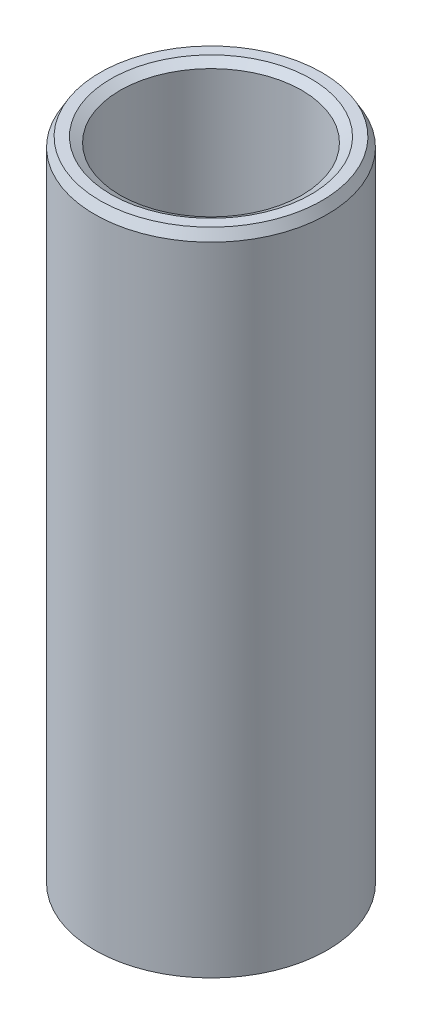
ISO-10303-21;
HEADER;
FILE_DESCRIPTION(('STEP AP214'),'2;1');
FILE_NAME('part.step','',(''),(''),'','','');
FILE_SCHEMA(('AUTOMOTIVE_DESIGN { 1 0 10303 214 1 1 1 1 }'));
ENDSEC;
DATA;
#1=APPLICATION_CONTEXT('core data for automotive mechanical design processes');
#2=APPLICATION_PROTOCOL_DEFINITION('international standard','automotive_design',2000,#1);
#3=PRODUCT_CONTEXT('',#1,'mechanical');
#4=PRODUCT('Part','Part','',(#3));
#5=PRODUCT_RELATED_PRODUCT_CATEGORY('part','',(#4));
#6=PRODUCT_DEFINITION_FORMATION('','',#4);
#7=PRODUCT_DEFINITION_CONTEXT('part definition',#1,'design');
#8=PRODUCT_DEFINITION('design','',#6,#7);
#9=PRODUCT_DEFINITION_SHAPE('','',#8);
#10=(LENGTH_UNIT() NAMED_UNIT(*) SI_UNIT(.MILLI.,.METRE.));
#11=(NAMED_UNIT(*) PLANE_ANGLE_UNIT() SI_UNIT($,.RADIAN.));
#12=(NAMED_UNIT(*) SI_UNIT($,.STERADIAN.) SOLID_ANGLE_UNIT());
#13=UNCERTAINTY_MEASURE_WITH_UNIT(LENGTH_MEASURE(1.E-05),#10,'distance_accuracy_value','');
#14=(GEOMETRIC_REPRESENTATION_CONTEXT(3) GLOBAL_UNCERTAINTY_ASSIGNED_CONTEXT((#13)) GLOBAL_UNIT_ASSIGNED_CONTEXT((#10,
#11,#12)) REPRESENTATION_CONTEXT('',''));
#15=CARTESIAN_POINT('',(0.,0.,0.));
#16=DIRECTION('',(0.,0.,1.));
#17=DIRECTION('',(1.,0.,0.));
#18=AXIS2_PLACEMENT_3D('',#15,#16,#17);
#19=CARTESIAN_POINT('',(0.,168.103531058881,0.));
#20=DIRECTION('',(0.,-1.,0.));
#21=DIRECTION('',(0.,0.,-1.));
#22=AXIS2_PLACEMENT_3D('',#19,#20,#21);
#23=CYLINDRICAL_SURFACE('',#22,30.);
#24=CARTESIAN_POINT('',(0.,1.37773613267428,0.));
#25=DIRECTION('',(0.,1.,0.));
#26=DIRECTION('',(0.,0.,1.));
#27=AXIS2_PLACEMENT_3D('',#24,#25,#26);
#28=CIRCLE('',#27,30.);
#29=CARTESIAN_POINT('',(0.,1.37773613267428,-30.));
#30=VERTEX_POINT('',#29);
#31=EDGE_CURVE('E10',#30,#30,#28,.T.);
#32=CARTESIAN_POINT('',(0.,165.717222077666,0.));
#33=DIRECTION('',(0.,1.,0.));
#34=DIRECTION('',(0.,0.,1.));
#35=AXIS2_PLACEMENT_3D('',#32,#33,#34);
#36=CIRCLE('',#35,30.);
#37=CARTESIAN_POINT('',(0.,165.717222077666,-30.));
#38=VERTEX_POINT('',#37);
#39=EDGE_CURVE('E50',#38,#38,#36,.F.);
#40=CARTESIAN_POINT('',(0.,1.37773613267428,-30.));
#41=CARTESIAN_POINT('',(0.,3.08960577793461,-30.));
#42=CARTESIAN_POINT('',(0.,4.80147542319494,-30.));
#43=CARTESIAN_POINT('',(0.,8.2252147137156,-30.));
#44=CARTESIAN_POINT('',(0.,9.93708435897594,-30.));
#45=CARTESIAN_POINT('',(0.,13.3608236494966,-30.));
#46=CARTESIAN_POINT('',(0.,15.0726932947569,-30.));
#47=CARTESIAN_POINT('',(0.,18.4964325852776,-30.));
#48=CARTESIAN_POINT('',(0.,20.2083022305379,-30.));
#49=CARTESIAN_POINT('',(0.,23.6320415210586,-30.));
#50=CARTESIAN_POINT('',(0.,25.3439111663189,-30.));
#51=CARTESIAN_POINT('',(0.,28.7676504568396,-30.));
#52=CARTESIAN_POINT('',(0.,30.4795201020999,-30.));
#53=CARTESIAN_POINT('',(0.,33.9032593926205,-30.));
#54=CARTESIAN_POINT('',(0.,35.6151290378809,-30.));
#55=CARTESIAN_POINT('',(0.,39.0388683284015,-30.));
#56=CARTESIAN_POINT('',(0.,40.7507379736619,-30.));
#57=CARTESIAN_POINT('',(0.,44.1744772641825,-30.));
#58=CARTESIAN_POINT('',(0.,45.8863469094429,-30.));
#59=CARTESIAN_POINT('',(0.,49.3100861999635,-30.));
#60=CARTESIAN_POINT('',(0.,51.0219558452239,-30.));
#61=CARTESIAN_POINT('',(0.,54.4456951357445,-30.));
#62=CARTESIAN_POINT('',(0.,56.1575647810048,-30.));
#63=CARTESIAN_POINT('',(0.,59.5813040715255,-30.));
#64=CARTESIAN_POINT('',(0.,61.2931737167858,-30.));
#65=CARTESIAN_POINT('',(0.,64.7169130073065,-30.));
#66=CARTESIAN_POINT('',(0.,66.4287826525668,-30.));
#67=CARTESIAN_POINT('',(0.,69.8525219430875,-30.));
#68=CARTESIAN_POINT('',(0.,71.5643915883478,-30.));
#69=CARTESIAN_POINT('',(0.,74.9881308788685,-30.));
#70=CARTESIAN_POINT('',(0.,76.7000005241288,-30.));
#71=CARTESIAN_POINT('',(0.,80.1237398146495,-30.));
#72=CARTESIAN_POINT('',(0.,81.8356094599098,-30.));
#73=CARTESIAN_POINT('',(0.,85.2593487504304,-30.));
#74=CARTESIAN_POINT('',(0.,86.9712183956908,-30.));
#75=CARTESIAN_POINT('',(0.,90.3949576862114,-30.));
#76=CARTESIAN_POINT('',(0.,92.1068273314718,-30.));
#77=CARTESIAN_POINT('',(0.,95.5305666219924,-30.));
#78=CARTESIAN_POINT('',(0.,97.2424362672528,-30.));
#79=CARTESIAN_POINT('',(0.,100.666175557773,-30.));
#80=CARTESIAN_POINT('',(0.,102.378045203034,-30.));
#81=CARTESIAN_POINT('',(0.,105.801784493554,-30.));
#82=CARTESIAN_POINT('',(0.,107.513654138815,-30.));
#83=CARTESIAN_POINT('',(0.,110.937393429335,-30.));
#84=CARTESIAN_POINT('',(0.,112.649263074596,-30.));
#85=CARTESIAN_POINT('',(0.,116.073002365116,-30.));
#86=CARTESIAN_POINT('',(0.,117.784872010377,-30.));
#87=CARTESIAN_POINT('',(0.,121.208611300897,-30.));
#88=CARTESIAN_POINT('',(0.,122.920480946158,-30.));
#89=CARTESIAN_POINT('',(0.,126.344220236678,-30.));
#90=CARTESIAN_POINT('',(0.,128.056089881939,-30.));
#91=CARTESIAN_POINT('',(0.,131.479829172459,-30.));
#92=CARTESIAN_POINT('',(0.,133.19169881772,-30.));
#93=CARTESIAN_POINT('',(0.,136.61543810824,-30.));
#94=CARTESIAN_POINT('',(0.,138.327307753501,-30.));
#95=CARTESIAN_POINT('',(0.,141.751047044021,-30.));
#96=CARTESIAN_POINT('',(0.,143.462916689282,-30.));
#97=CARTESIAN_POINT('',(0.,146.886655979802,-30.));
#98=CARTESIAN_POINT('',(0.,148.598525625063,-30.));
#99=CARTESIAN_POINT('',(0.,152.022264915583,-30.));
#100=CARTESIAN_POINT('',(0.,153.734134560844,-30.));
#101=CARTESIAN_POINT('',(0.,157.157873851364,-30.));
#102=CARTESIAN_POINT('',(0.,158.869743496625,-30.));
#103=CARTESIAN_POINT('',(0.,162.293482787145,-30.));
#104=CARTESIAN_POINT('',(0.,164.005352432406,-30.));
#105=CARTESIAN_POINT('',(0.,165.717222077666,-30.));
#106=B_SPLINE_CURVE_WITH_KNOTS('',3,(#40,#41,#42,#43,#44,#45,#46,#47,#48,#49,#50,#51,#52,#53,
#54,#55,#56,#57,#58,#59,#60,#61,#62,#63,#64,#65,#66,#67,#68,#69,#70,#71,#72,#73,#74,#75,#76,#77,
#78,#79,#80,#81,#82,#83,#84,#85,#86,#87,#88,#89,#90,#91,#92,#93,#94,#95,#96,#97,#98,#99,#100,
#101,#102,#103,#104,#105),.UNSPECIFIED.,.F.,.F.,(4,2,2,2,2,2,2,2,2,2,2,2,2,2,2,2,2,2,2,2,2,2,2,
2,2,2,2,2,2,2,2,2,4),(0.,5.13560893578099,10.271217871562,15.406826807343,20.542435743124,
25.6780446789049,30.8136536146859,35.9492625504669,41.0848714862479,46.2204804220289,
51.3560893578099,56.4916982935909,61.6273072293719,66.7629161651529,71.8985251009339,
77.0341340367148,82.1697429724958,87.3053519082768,92.4409608440578,97.5765697798388,
102.71217871562,107.847787651401,112.983396587182,118.119005522963,123.254614458744,
128.390223394525,133.525832330306,138.661441266087,143.797050201868,148.932659137649,
154.06826807343,159.203877009211,164.339485944992),.UNSPECIFIED.);
#107=EDGE_CURVE('BSEAM39',#30,#38,#106,.T.);
#108=ORIENTED_EDGE('',*,*,#31,.T.);
#109=ORIENTED_EDGE('',*,*,#39,.T.);
#110=ORIENTED_EDGE('',*,*,#107,.T.);
#111=ORIENTED_EDGE('',*,*,#107,.F.);
#112=EDGE_LOOP('',(#108,#110,#109,#111));
#113=FACE_BOUND('',#112,.T.);
#114=ADVANCED_FACE('F39',(#113),#23,.T.);
#115=CARTESIAN_POINT('',(0.,168.103531058881,0.));
#116=DIRECTION('',(0.,1.,0.));
#117=DIRECTION('',(0.,0.,1.));
#118=AXIS2_PLACEMENT_3D('',#115,#116,#117);
#119=PLANE('',#118);
#120=CARTESIAN_POINT('',(0.,168.103531058881,0.));
#121=DIRECTION('',(0.,1.,0.));
#122=DIRECTION('',(0.,0.,1.));
#123=AXIS2_PLACEMENT_3D('',#120,#121,#122);
#124=CIRCLE('',#123,25.8177116797901);
#125=CARTESIAN_POINT('',(0.,168.103531058881,25.8177116797901));
#126=VERTEX_POINT('',#125);
#127=EDGE_CURVE('E58',#126,#126,#124,.F.);
#128=ORIENTED_EDGE('',*,*,#127,.T.);
#129=EDGE_LOOP('',(#128));
#130=FACE_BOUND('',#129,.T.);
#131=CARTESIAN_POINT('',(0.,168.103531058881,0.));
#132=DIRECTION('',(0.,1.,0.));
#133=DIRECTION('',(0.,0.,1.));
#134=AXIS2_PLACEMENT_3D('',#131,#132,#133);
#135=CIRCLE('',#134,28.6222638673258);
#136=CARTESIAN_POINT('',(0.,168.103531058881,28.6222638673258));
#137=VERTEX_POINT('',#136);
#138=EDGE_CURVE('E61',#137,#137,#135,.T.);
#139=ORIENTED_EDGE('',*,*,#138,.T.);
#140=EDGE_LOOP('',(#139));
#141=FACE_BOUND('',#140,.T.);
#142=ADVANCED_FACE('F88',(#130,#141),#119,.T.);
#143=CARTESIAN_POINT('',(0.,0.,0.));
#144=DIRECTION('',(0.,1.,0.));
#145=DIRECTION('',(0.,0.,1.));
#146=AXIS2_PLACEMENT_3D('',#143,#144,#145);
#147=PLANE('',#146);
#148=CARTESIAN_POINT('',(0.,0.,0.));
#149=DIRECTION('',(0.,1.,0.));
#150=DIRECTION('',(0.,0.,1.));
#151=AXIS2_PLACEMENT_3D('',#148,#149,#150);
#152=CIRCLE('',#151,24.809138831249);
#153=CARTESIAN_POINT('',(0.,0.,24.809138831249));
#154=VERTEX_POINT('',#153);
#155=EDGE_CURVE('E51',#154,#154,#152,.T.);
#156=ORIENTED_EDGE('',*,*,#155,.T.);
#157=EDGE_LOOP('',(#156));
#158=FACE_BOUND('',#157,.T.);
#159=CARTESIAN_POINT('',(0.,0.,0.));
#160=DIRECTION('',(0.,1.,0.));
#161=DIRECTION('',(0.,0.,1.));
#162=AXIS2_PLACEMENT_3D('',#159,#160,#161);
#163=CIRCLE('',#162,27.6136910187847);
#164=CARTESIAN_POINT('',(0.,0.,27.6136910187847));
#165=VERTEX_POINT('',#164);
#166=EDGE_CURVE('E54',#165,#165,#163,.F.);
#167=ORIENTED_EDGE('',*,*,#166,.T.);
#168=EDGE_LOOP('',(#167));
#169=FACE_BOUND('',#168,.T.);
#170=ADVANCED_FACE('F83',(#158,#169),#147,.F.);
#171=CARTESIAN_POINT('',(0.,168.103531058881,0.));
#172=DIRECTION('',(0.,-1.,0.));
#173=DIRECTION('',(0.,0.,-1.));
#174=AXIS2_PLACEMENT_3D('',#171,#172,#173);
#175=CYLINDRICAL_SURFACE('',#174,23.4314026985748);
#176=CARTESIAN_POINT('',(0.,166.725794926207,0.));
#177=DIRECTION('',(0.,1.,0.));
#178=DIRECTION('',(0.,0.,1.));
#179=AXIS2_PLACEMENT_3D('',#176,#177,#178);
#180=CIRCLE('',#179,23.4314026985748);
#181=CARTESIAN_POINT('',(0.,166.725794926207,-23.4314026985748));
#182=VERTEX_POINT('',#181);
#183=EDGE_CURVE('E67',#182,#182,#180,.T.);
#184=CARTESIAN_POINT('',(0.,2.38630898121514,0.));
#185=DIRECTION('',(0.,1.,0.));
#186=DIRECTION('',(0.,0.,1.));
#187=AXIS2_PLACEMENT_3D('',#184,#185,#186);
#188=CIRCLE('',#187,23.4314026985748);
#189=CARTESIAN_POINT('',(0.,2.38630898121511,-23.4314026985748));
#190=VERTEX_POINT('',#189);
#191=EDGE_CURVE('E69',#190,#190,#188,.F.);
#192=CARTESIAN_POINT('',(0.,166.725794926207,-23.4314026985748));
#193=CARTESIAN_POINT('',(0.,165.013925280946,-23.4314026985748));
#194=CARTESIAN_POINT('',(0.,163.302055635686,-23.4314026985748));
#195=CARTESIAN_POINT('',(0.,159.878316345165,-23.4314026985748));
#196=CARTESIAN_POINT('',(0.,158.166446699905,-23.4314026985748));
#197=CARTESIAN_POINT('',(0.,154.742707409384,-23.4314026985748));
#198=CARTESIAN_POINT('',(0.,153.030837764124,-23.4314026985748));
#199=CARTESIAN_POINT('',(0.,149.607098473603,-23.4314026985748));
#200=CARTESIAN_POINT('',(0.,147.895228828343,-23.4314026985748));
#201=CARTESIAN_POINT('',(0.,144.471489537822,-23.4314026985748));
#202=CARTESIAN_POINT('',(0.,142.759619892562,-23.4314026985748));
#203=CARTESIAN_POINT('',(0.,139.335880602041,-23.4314026985748));
#204=CARTESIAN_POINT('',(0.,137.624010956781,-23.4314026985748));
#205=CARTESIAN_POINT('',(0.,134.200271666261,-23.4314026985748));
#206=CARTESIAN_POINT('',(0.,132.488402021,-23.4314026985748));
#207=CARTESIAN_POINT('',(0.,129.06466273048,-23.4314026985748));
#208=CARTESIAN_POINT('',(0.,127.352793085219,-23.4314026985748));
#209=CARTESIAN_POINT('',(0.,123.929053794699,-23.4314026985748));
#210=CARTESIAN_POINT('',(0.,122.217184149438,-23.4314026985748));
#211=CARTESIAN_POINT('',(0.,118.793444858918,-23.4314026985748));
#212=CARTESIAN_POINT('',(0.,117.081575213657,-23.4314026985748));
#213=CARTESIAN_POINT('',(0.,113.657835923137,-23.4314026985748));
#214=CARTESIAN_POINT('',(0.,111.945966277876,-23.4314026985748));
#215=CARTESIAN_POINT('',(0.,108.522226987356,-23.4314026985748));
#216=CARTESIAN_POINT('',(0.,106.810357342095,-23.4314026985748));
#217=CARTESIAN_POINT('',(0.,103.386618051575,-23.4314026985748));
#218=CARTESIAN_POINT('',(0.,101.674748406314,-23.4314026985748));
#219=CARTESIAN_POINT('',(0.,98.2510091157936,-23.4314026985748));
#220=CARTESIAN_POINT('',(0.,96.5391394705332,-23.4314026985748));
#221=CARTESIAN_POINT('',(0.,93.1154001800126,-23.4314026985748));
#222=CARTESIAN_POINT('',(0.,91.4035305347523,-23.4314026985748));
#223=CARTESIAN_POINT('',(0.,87.9797912442316,-23.4314026985748));
#224=CARTESIAN_POINT('',(0.,86.2679215989713,-23.4314026985748));
#225=CARTESIAN_POINT('',(0.,82.8441823084506,-23.4314026985748));
#226=CARTESIAN_POINT('',(0.,81.1323126631903,-23.4314026985748));
#227=CARTESIAN_POINT('',(0.,77.7085733726696,-23.4314026985748));
#228=CARTESIAN_POINT('',(0.,75.9967037274093,-23.4314026985748));
#229=CARTESIAN_POINT('',(0.,72.5729644368886,-23.4314026985748));
#230=CARTESIAN_POINT('',(0.,70.8610947916283,-23.4314026985748));
#231=CARTESIAN_POINT('',(0.,67.4373555011076,-23.4314026985748));
#232=CARTESIAN_POINT('',(0.,65.7254858558473,-23.4314026985748));
#233=CARTESIAN_POINT('',(0.,62.3017465653266,-23.4314026985748));
#234=CARTESIAN_POINT('',(0.,60.5898769200663,-23.4314026985748));
#235=CARTESIAN_POINT('',(0.,57.1661376295457,-23.4314026985748));
#236=CARTESIAN_POINT('',(0.,55.4542679842853,-23.4314026985748));
#237=CARTESIAN_POINT('',(0.,52.0305286937647,-23.4314026985748));
#238=CARTESIAN_POINT('',(0.,50.3186590485043,-23.4314026985748));
#239=CARTESIAN_POINT('',(0.,46.8949197579837,-23.4314026985748));
#240=CARTESIAN_POINT('',(0.,45.1830501127233,-23.4314026985748));
#241=CARTESIAN_POINT('',(0.,41.7593108222027,-23.4314026985748));
#242=CARTESIAN_POINT('',(0.,40.0474411769424,-23.4314026985748));
#243=CARTESIAN_POINT('',(0.,36.6237018864217,-23.4314026985748));
#244=CARTESIAN_POINT('',(0.,34.9118322411614,-23.4314026985748));
#245=CARTESIAN_POINT('',(0.,31.4880929506407,-23.4314026985748));
#246=CARTESIAN_POINT('',(0.,29.7762233053804,-23.4314026985748));
#247=CARTESIAN_POINT('',(0.,26.3524840148597,-23.4314026985748));
#248=CARTESIAN_POINT('',(0.,24.6406143695994,-23.4314026985748));
#249=CARTESIAN_POINT('',(0.,21.2168750790788,-23.4314026985748));
#250=CARTESIAN_POINT('',(0.,19.5050054338184,-23.4314026985748));
#251=CARTESIAN_POINT('',(0.,16.0812661432977,-23.4314026985748));
#252=CARTESIAN_POINT('',(0.,14.3693964980374,-23.4314026985748));
#253=CARTESIAN_POINT('',(0.,10.9456572075168,-23.4314026985748));
#254=CARTESIAN_POINT('',(0.,9.23378756225642,-23.4314026985748));
#255=CARTESIAN_POINT('',(0.,5.81004827173576,-23.4314026985748));
#256=CARTESIAN_POINT('',(0.,4.09817862647543,-23.4314026985748));
#257=CARTESIAN_POINT('',(0.,2.38630898121511,-23.4314026985748));
#258=B_SPLINE_CURVE_WITH_KNOTS('',3,(#192,#193,#194,#195,#196,#197,#198,#199,#200,#201,#202,
#203,#204,#205,#206,#207,#208,#209,#210,#211,#212,#213,#214,#215,#216,#217,#218,#219,#220,#221,
#222,#223,#224,#225,#226,#227,#228,#229,#230,#231,#232,#233,#234,#235,#236,#237,#238,#239,#240,
#241,#242,#243,#244,#245,#246,#247,#248,#249,#250,#251,#252,#253,#254,#255,#256,#257),
.UNSPECIFIED.,.F.,.F.,(4,2,2,2,2,2,2,2,2,2,2,2,2,2,2,2,2,2,2,2,2,2,2,2,2,2,2,2,2,2,2,2,4),(0.,
5.13560893578099,10.271217871562,15.406826807343,20.542435743124,25.678044678905,
30.8136536146859,35.9492625504669,41.0848714862479,46.2204804220289,51.3560893578099,
56.4916982935909,61.6273072293719,66.7629161651529,71.8985251009339,77.0341340367149,
82.1697429724959,87.3053519082768,92.4409608440578,97.5765697798388,102.71217871562,
107.847787651401,112.983396587182,118.119005522963,123.254614458744,128.390223394525,
133.525832330306,138.661441266087,143.797050201868,148.932659137649,154.06826807343,
159.203877009211,164.339485944992),.UNSPECIFIED.);
#259=EDGE_CURVE('BSEAM71',#182,#190,#258,.T.);
#260=ORIENTED_EDGE('',*,*,#183,.T.);
#261=ORIENTED_EDGE('',*,*,#191,.T.);
#262=ORIENTED_EDGE('',*,*,#259,.T.);
#263=ORIENTED_EDGE('',*,*,#259,.F.);
#264=EDGE_LOOP('',(#260,#262,#261,#263));
#265=FACE_BOUND('',#264,.T.);
#266=ADVANCED_FACE('F71',(#265),#175,.F.);
#267=CARTESIAN_POINT('',(0.,166.725794926207,0.));
#268=DIRECTION('',(0.,1.,0.));
#269=DIRECTION('',(0.,0.,1.));
#270=AXIS2_PLACEMENT_3D('',#267,#268,#269);
#271=CONICAL_SURFACE('',#270,23.4314026985748,1.04719755119659);
#272=ORIENTED_EDGE('',*,*,#127,.F.);
#273=EDGE_LOOP('',(#272));
#274=FACE_BOUND('',#273,.T.);
#275=ORIENTED_EDGE('',*,*,#183,.F.);
#276=EDGE_LOOP('',(#275));
#277=FACE_BOUND('',#276,.T.);
#278=ADVANCED_FACE('F77',(#274,#277),#271,.F.);
#279=CARTESIAN_POINT('',(0.,0.,0.));
#280=DIRECTION('',(0.,-1.,0.));
#281=DIRECTION('',(0.,0.,-1.));
#282=AXIS2_PLACEMENT_3D('',#279,#280,#281);
#283=CONICAL_SURFACE('',#282,24.809138831249,0.523598775598295);
#284=ORIENTED_EDGE('',*,*,#191,.F.);
#285=EDGE_LOOP('',(#284));
#286=FACE_BOUND('',#285,.T.);
#287=ORIENTED_EDGE('',*,*,#155,.F.);
#288=EDGE_LOOP('',(#287));
#289=FACE_BOUND('',#288,.T.);
#290=ADVANCED_FACE('F73',(#286,#289),#283,.F.);
#291=CARTESIAN_POINT('',(0.,1.37773613267425,0.));
#292=DIRECTION('',(0.,1.,0.));
#293=DIRECTION('',(0.,0.,1.));
#294=AXIS2_PLACEMENT_3D('',#291,#292,#293);
#295=CONICAL_SURFACE('',#294,30.,1.04719755119661);
#296=ORIENTED_EDGE('',*,*,#166,.F.);
#297=EDGE_LOOP('',(#296));
#298=FACE_BOUND('',#297,.T.);
#299=ORIENTED_EDGE('',*,*,#31,.F.);
#300=EDGE_LOOP('',(#299));
#301=FACE_BOUND('',#300,.T.);
#302=ADVANCED_FACE('F76',(#298,#301),#295,.T.);
#303=CARTESIAN_POINT('',(0.,168.103531058881,0.));
#304=DIRECTION('',(0.,-1.,0.));
#305=DIRECTION('',(0.,0.,-1.));
#306=AXIS2_PLACEMENT_3D('',#303,#304,#305);
#307=CONICAL_SURFACE('',#306,28.6222638673258,0.523598775598296);
#308=ORIENTED_EDGE('',*,*,#39,.F.);
#309=EDGE_LOOP('',(#308));
#310=FACE_BOUND('',#309,.T.);
#311=ORIENTED_EDGE('',*,*,#138,.F.);
#312=EDGE_LOOP('',(#311));
#313=FACE_BOUND('',#312,.T.);
#314=ADVANCED_FACE('F45',(#310,#313),#307,.T.);
#315=CLOSED_SHELL('',(#114,#142,#170,#266,#278,#290,#302,#314));
#316=MANIFOLD_SOLID_BREP('B2',#315);
#317=ADVANCED_BREP_SHAPE_REPRESENTATION('',(#18,#316),#14);
#318=SHAPE_DEFINITION_REPRESENTATION(#9,#317);
ENDSEC;
END-ISO-10303-21;
